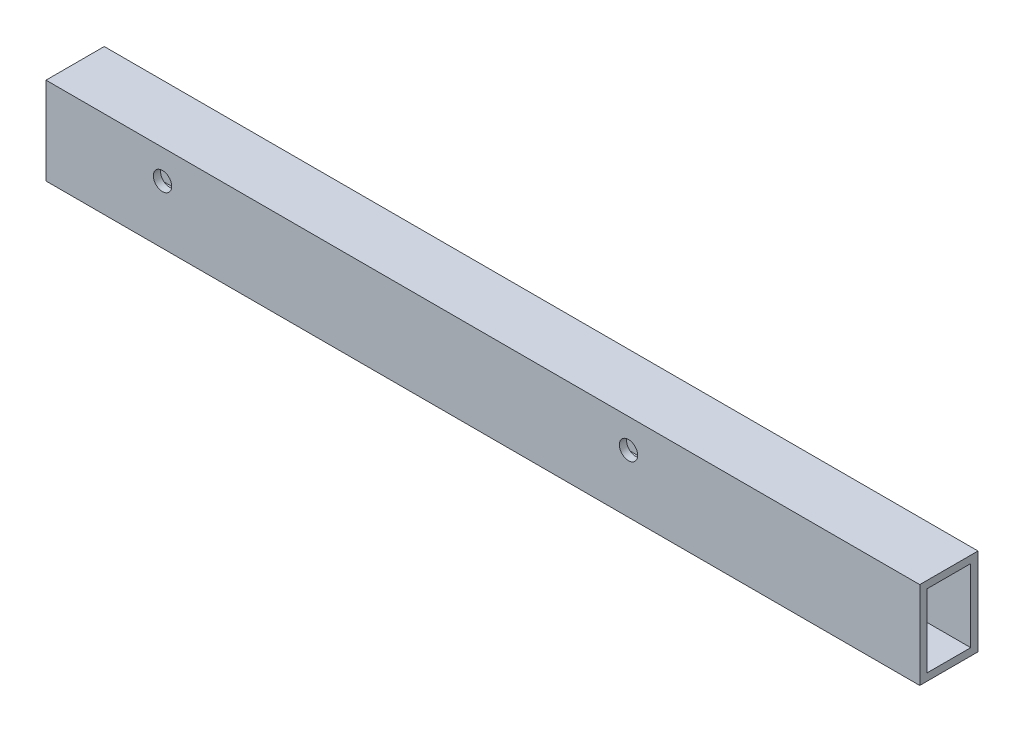
ISO-10303-21;
HEADER;
FILE_DESCRIPTION(('STEP AP214'),'2;1');
FILE_NAME('part.step','',(''),(''),'','','');
FILE_SCHEMA(('AUTOMOTIVE_DESIGN { 1 0 10303 214 1 1 1 1 }'));
ENDSEC;
DATA;
#1=APPLICATION_CONTEXT('core data for automotive mechanical design processes');
#2=APPLICATION_PROTOCOL_DEFINITION('international standard','automotive_design',2000,#1);
#3=PRODUCT_CONTEXT('',#1,'mechanical');
#4=PRODUCT('Part','Part','',(#3));
#5=PRODUCT_RELATED_PRODUCT_CATEGORY('part','',(#4));
#6=PRODUCT_DEFINITION_FORMATION('','',#4);
#7=PRODUCT_DEFINITION_CONTEXT('part definition',#1,'design');
#8=PRODUCT_DEFINITION('design','',#6,#7);
#9=PRODUCT_DEFINITION_SHAPE('','',#8);
#10=(LENGTH_UNIT() NAMED_UNIT(*) SI_UNIT(.MILLI.,.METRE.));
#11=(NAMED_UNIT(*) PLANE_ANGLE_UNIT() SI_UNIT($,.RADIAN.));
#12=(NAMED_UNIT(*) SI_UNIT($,.STERADIAN.) SOLID_ANGLE_UNIT());
#13=UNCERTAINTY_MEASURE_WITH_UNIT(LENGTH_MEASURE(1.E-05),#10,'distance_accuracy_value','');
#14=(GEOMETRIC_REPRESENTATION_CONTEXT(3) GLOBAL_UNCERTAINTY_ASSIGNED_CONTEXT((#13)) GLOBAL_UNIT_ASSIGNED_CONTEXT((#10,
#11,#12)) REPRESENTATION_CONTEXT('',''));
#15=CARTESIAN_POINT('',(0.,0.,0.));
#16=DIRECTION('',(0.,0.,1.));
#17=DIRECTION('',(1.,0.,0.));
#18=AXIS2_PLACEMENT_3D('',#15,#16,#17);
#19=CARTESIAN_POINT('',(381.,0.,0.));
#20=DIRECTION('',(-1.,0.,0.));
#21=DIRECTION('',(0.,0.,1.));
#22=AXIS2_PLACEMENT_3D('',#19,#20,#21);
#23=PLANE('',#22);
#24=DIRECTION('',(0.,1.,0.));
#25=VECTOR('',#24,1.);
#26=CARTESIAN_POINT('',(381.,-19.05,-12.7));
#27=LINE('',#26,#25);
#28=CARTESIAN_POINT('',(381.,-19.05,-12.7));
#29=VERTEX_POINT('',#28);
#30=CARTESIAN_POINT('',(381.,19.05,-12.7));
#31=VERTEX_POINT('',#30);
#32=EDGE_CURVE('E156',#29,#31,#27,.T.);
#33=ORIENTED_EDGE('',*,*,#32,.T.);
#34=DIRECTION('',(0.,0.,1.));
#35=VECTOR('',#34,1.);
#36=CARTESIAN_POINT('',(381.,19.05,12.7));
#37=LINE('',#36,#35);
#38=CARTESIAN_POINT('',(381.,19.05,12.7));
#39=VERTEX_POINT('',#38);
#40=EDGE_CURVE('E160',#31,#39,#37,.T.);
#41=ORIENTED_EDGE('',*,*,#40,.T.);
#42=DIRECTION('',(0.,-1.,0.));
#43=VECTOR('',#42,1.);
#44=CARTESIAN_POINT('',(381.,-19.05,12.7));
#45=LINE('',#44,#43);
#46=CARTESIAN_POINT('',(381.,-19.05,12.7));
#47=VERTEX_POINT('',#46);
#48=EDGE_CURVE('E164',#39,#47,#45,.T.);
#49=ORIENTED_EDGE('',*,*,#48,.T.);
#50=DIRECTION('',(0.,0.,-1.));
#51=VECTOR('',#50,1.);
#52=CARTESIAN_POINT('',(381.,-19.05,12.7));
#53=LINE('',#52,#51);
#54=EDGE_CURVE('E167',#47,#29,#53,.T.);
#55=ORIENTED_EDGE('',*,*,#54,.T.);
#56=EDGE_LOOP('',(#33,#41,#49,#55));
#57=FACE_BOUND('',#56,.T.);
#58=DIRECTION('',(0.,0.,-1.));
#59=VECTOR('',#58,1.);
#60=CARTESIAN_POINT('',(381.,-15.875,9.525));
#61=LINE('',#60,#59);
#62=CARTESIAN_POINT('',(381.,-15.875,9.525));
#63=VERTEX_POINT('',#62);
#64=CARTESIAN_POINT('',(381.,-15.875,-9.525));
#65=VERTEX_POINT('',#64);
#66=EDGE_CURVE('E106',#63,#65,#61,.T.);
#67=ORIENTED_EDGE('',*,*,#66,.F.);
#68=DIRECTION('',(0.,-1.,0.));
#69=VECTOR('',#68,1.);
#70=CARTESIAN_POINT('',(381.,-15.875,9.525));
#71=LINE('',#70,#69);
#72=CARTESIAN_POINT('',(381.,15.875,9.525));
#73=VERTEX_POINT('',#72);
#74=EDGE_CURVE('E132',#73,#63,#71,.T.);
#75=ORIENTED_EDGE('',*,*,#74,.F.);
#76=DIRECTION('',(0.,0.,1.));
#77=VECTOR('',#76,1.);
#78=CARTESIAN_POINT('',(381.,15.875,9.525));
#79=LINE('',#78,#77);
#80=CARTESIAN_POINT('',(381.,15.875,-9.525));
#81=VERTEX_POINT('',#80);
#82=EDGE_CURVE('E128',#81,#73,#79,.T.);
#83=ORIENTED_EDGE('',*,*,#82,.F.);
#84=DIRECTION('',(0.,1.,0.));
#85=VECTOR('',#84,1.);
#86=CARTESIAN_POINT('',(381.,-15.875,-9.525));
#87=LINE('',#86,#85);
#88=EDGE_CURVE('E115',#65,#81,#87,.T.);
#89=ORIENTED_EDGE('',*,*,#88,.F.);
#90=EDGE_LOOP('',(#67,#75,#83,#89));
#91=FACE_BOUND('',#90,.T.);
#92=ADVANCED_FACE('F38',(#57,#91),#23,.F.);
#93=CARTESIAN_POINT('',(0.,0.,0.));
#94=DIRECTION('',(-1.,0.,0.));
#95=DIRECTION('',(0.,0.,1.));
#96=AXIS2_PLACEMENT_3D('',#93,#94,#95);
#97=PLANE('',#96);
#98=DIRECTION('',(0.,1.,0.));
#99=VECTOR('',#98,1.);
#100=CARTESIAN_POINT('',(0.,-19.05,-12.7));
#101=LINE('',#100,#99);
#102=CARTESIAN_POINT('',(0.,-19.05,-12.7));
#103=VERTEX_POINT('',#102);
#104=CARTESIAN_POINT('',(0.,19.05,-12.7));
#105=VERTEX_POINT('',#104);
#106=EDGE_CURVE('E124',#103,#105,#101,.T.);
#107=ORIENTED_EDGE('',*,*,#106,.F.);
#108=DIRECTION('',(0.,0.,-1.));
#109=VECTOR('',#108,1.);
#110=CARTESIAN_POINT('',(0.,-19.05,12.7));
#111=LINE('',#110,#109);
#112=CARTESIAN_POINT('',(0.,-19.05,12.7));
#113=VERTEX_POINT('',#112);
#114=EDGE_CURVE('E161',#113,#103,#111,.T.);
#115=ORIENTED_EDGE('',*,*,#114,.F.);
#116=DIRECTION('',(0.,-1.,0.));
#117=VECTOR('',#116,1.);
#118=CARTESIAN_POINT('',(0.,-19.05,12.7));
#119=LINE('',#118,#117);
#120=CARTESIAN_POINT('',(0.,19.05,12.7));
#121=VERTEX_POINT('',#120);
#122=EDGE_CURVE('E177',#121,#113,#119,.T.);
#123=ORIENTED_EDGE('',*,*,#122,.F.);
#124=DIRECTION('',(0.,0.,1.));
#125=VECTOR('',#124,1.);
#126=CARTESIAN_POINT('',(0.,19.05,12.7));
#127=LINE('',#126,#125);
#128=EDGE_CURVE('E174',#105,#121,#127,.T.);
#129=ORIENTED_EDGE('',*,*,#128,.F.);
#130=EDGE_LOOP('',(#107,#115,#123,#129));
#131=FACE_BOUND('',#130,.T.);
#132=DIRECTION('',(0.,-1.,0.));
#133=VECTOR('',#132,1.);
#134=CARTESIAN_POINT('',(0.,-15.875,9.525));
#135=LINE('',#134,#133);
#136=CARTESIAN_POINT('',(0.,15.875,9.525));
#137=VERTEX_POINT('',#136);
#138=CARTESIAN_POINT('',(0.,-15.875,9.525));
#139=VERTEX_POINT('',#138);
#140=EDGE_CURVE('E116',#137,#139,#135,.T.);
#141=ORIENTED_EDGE('',*,*,#140,.T.);
#142=DIRECTION('',(0.,0.,-1.));
#143=VECTOR('',#142,1.);
#144=CARTESIAN_POINT('',(0.,-15.875,9.525));
#145=LINE('',#144,#143);
#146=CARTESIAN_POINT('',(0.,-15.875,-9.525));
#147=VERTEX_POINT('',#146);
#148=EDGE_CURVE('E64',#139,#147,#145,.T.);
#149=ORIENTED_EDGE('',*,*,#148,.T.);
#150=DIRECTION('',(0.,1.,0.));
#151=VECTOR('',#150,1.);
#152=CARTESIAN_POINT('',(0.,-15.875,-9.525));
#153=LINE('',#152,#151);
#154=CARTESIAN_POINT('',(0.,15.875,-9.525));
#155=VERTEX_POINT('',#154);
#156=EDGE_CURVE('E122',#147,#155,#153,.T.);
#157=ORIENTED_EDGE('',*,*,#156,.T.);
#158=DIRECTION('',(0.,0.,1.));
#159=VECTOR('',#158,1.);
#160=CARTESIAN_POINT('',(0.,15.875,9.525));
#161=LINE('',#160,#159);
#162=EDGE_CURVE('E143',#155,#137,#161,.T.);
#163=ORIENTED_EDGE('',*,*,#162,.T.);
#164=EDGE_LOOP('',(#141,#149,#157,#163));
#165=FACE_BOUND('',#164,.T.);
#166=ADVANCED_FACE('F237',(#131,#165),#97,.T.);
#167=CARTESIAN_POINT('',(381.,-19.05,-12.7));
#168=DIRECTION('',(0.,0.,1.));
#169=DIRECTION('',(1.,0.,0.));
#170=AXIS2_PLACEMENT_3D('',#167,#168,#169);
#171=PLANE('',#170);
#172=CARTESIAN_POINT('',(50.8,6.35,-12.7));
#173=DIRECTION('',(0.,0.,-1.));
#174=DIRECTION('',(-1.,0.,0.));
#175=AXIS2_PLACEMENT_3D('',#172,#173,#174);
#176=CIRCLE('',#175,3.99999999999999);
#177=CARTESIAN_POINT('',(46.8,6.35,-12.7));
#178=VERTEX_POINT('',#177);
#179=EDGE_CURVE('E203',#178,#178,#176,.T.);
#180=ORIENTED_EDGE('',*,*,#179,.F.);
#181=EDGE_LOOP('',(#180));
#182=FACE_BOUND('',#181,.T.);
#183=CARTESIAN_POINT('',(254.,6.34999999999997,-12.7));
#184=DIRECTION('',(0.,0.,-1.));
#185=DIRECTION('',(-1.,0.,0.));
#186=AXIS2_PLACEMENT_3D('',#183,#184,#185);
#187=CIRCLE('',#186,3.99999999999999);
#188=CARTESIAN_POINT('',(250.,6.34999999999997,-12.7));
#189=VERTEX_POINT('',#188);
#190=EDGE_CURVE('E215',#189,#189,#187,.T.);
#191=ORIENTED_EDGE('',*,*,#190,.F.);
#192=EDGE_LOOP('',(#191));
#193=FACE_BOUND('',#192,.T.);
#194=ORIENTED_EDGE('',*,*,#106,.T.);
#195=DIRECTION('',(-1.,0.,0.));
#196=VECTOR('',#195,1.);
#197=CARTESIAN_POINT('',(381.,19.05,-12.7));
#198=LINE('',#197,#196);
#199=EDGE_CURVE('E11',#31,#105,#198,.T.);
#200=ORIENTED_EDGE('',*,*,#199,.F.);
#201=ORIENTED_EDGE('',*,*,#32,.F.);
#202=DIRECTION('',(-1.,0.,0.));
#203=VECTOR('',#202,1.);
#204=CARTESIAN_POINT('',(381.,-19.05,-12.7));
#205=LINE('',#204,#203);
#206=EDGE_CURVE('E170',#29,#103,#205,.T.);
#207=ORIENTED_EDGE('',*,*,#206,.T.);
#208=EDGE_LOOP('',(#194,#200,#201,#207));
#209=FACE_BOUND('',#208,.T.);
#210=ADVANCED_FACE('F40',(#182,#193,#209),#171,.F.);
#211=CARTESIAN_POINT('',(381.,19.05,12.7));
#212=DIRECTION('',(0.,-1.,0.));
#213=DIRECTION('',(0.,0.,-1.));
#214=AXIS2_PLACEMENT_3D('',#211,#212,#213);
#215=PLANE('',#214);
#216=ORIENTED_EDGE('',*,*,#128,.T.);
#217=DIRECTION('',(-1.,0.,0.));
#218=VECTOR('',#217,1.);
#219=CARTESIAN_POINT('',(381.,19.05,12.7));
#220=LINE('',#219,#218);
#221=EDGE_CURVE('E48',#39,#121,#220,.T.);
#222=ORIENTED_EDGE('',*,*,#221,.F.);
#223=ORIENTED_EDGE('',*,*,#40,.F.);
#224=ORIENTED_EDGE('',*,*,#199,.T.);
#225=EDGE_LOOP('',(#216,#222,#223,#224));
#226=FACE_BOUND('',#225,.T.);
#227=ADVANCED_FACE('F264',(#226),#215,.F.);
#228=CARTESIAN_POINT('',(381.,-19.05,12.7));
#229=DIRECTION('',(0.,0.,-1.));
#230=DIRECTION('',(-1.,0.,0.));
#231=AXIS2_PLACEMENT_3D('',#228,#229,#230);
#232=PLANE('',#231);
#233=CARTESIAN_POINT('',(50.8,6.35,12.7));
#234=DIRECTION('',(0.,0.,-1.));
#235=DIRECTION('',(-1.,0.,0.));
#236=AXIS2_PLACEMENT_3D('',#233,#234,#235);
#237=CIRCLE('',#236,3.99999999999999);
#238=CARTESIAN_POINT('',(46.8,6.35,12.7));
#239=VERTEX_POINT('',#238);
#240=EDGE_CURVE('E195',#239,#239,#237,.T.);
#241=ORIENTED_EDGE('',*,*,#240,.T.);
#242=EDGE_LOOP('',(#241));
#243=FACE_BOUND('',#242,.T.);
#244=CARTESIAN_POINT('',(254.,6.34999999999997,12.7));
#245=DIRECTION('',(0.,0.,-1.));
#246=DIRECTION('',(-1.,0.,0.));
#247=AXIS2_PLACEMENT_3D('',#244,#245,#246);
#248=CIRCLE('',#247,3.99999999999999);
#249=CARTESIAN_POINT('',(250.,6.34999999999997,12.7));
#250=VERTEX_POINT('',#249);
#251=EDGE_CURVE('E209',#250,#250,#248,.T.);
#252=ORIENTED_EDGE('',*,*,#251,.T.);
#253=EDGE_LOOP('',(#252));
#254=FACE_BOUND('',#253,.T.);
#255=ORIENTED_EDGE('',*,*,#122,.T.);
#256=DIRECTION('',(-1.,0.,0.));
#257=VECTOR('',#256,1.);
#258=CARTESIAN_POINT('',(381.,-19.05,12.7));
#259=LINE('',#258,#257);
#260=EDGE_CURVE('E185',#47,#113,#259,.T.);
#261=ORIENTED_EDGE('',*,*,#260,.F.);
#262=ORIENTED_EDGE('',*,*,#48,.F.);
#263=ORIENTED_EDGE('',*,*,#221,.T.);
#264=EDGE_LOOP('',(#255,#261,#262,#263));
#265=FACE_BOUND('',#264,.T.);
#266=ADVANCED_FACE('F261',(#243,#254,#265),#232,.F.);
#267=CARTESIAN_POINT('',(381.,-19.05,12.7));
#268=DIRECTION('',(0.,1.,0.));
#269=DIRECTION('',(0.,0.,1.));
#270=AXIS2_PLACEMENT_3D('',#267,#268,#269);
#271=PLANE('',#270);
#272=ORIENTED_EDGE('',*,*,#114,.T.);
#273=ORIENTED_EDGE('',*,*,#206,.F.);
#274=ORIENTED_EDGE('',*,*,#54,.F.);
#275=ORIENTED_EDGE('',*,*,#260,.T.);
#276=EDGE_LOOP('',(#272,#273,#274,#275));
#277=FACE_BOUND('',#276,.T.);
#278=ADVANCED_FACE('F258',(#277),#271,.F.);
#279=CARTESIAN_POINT('',(381.,-15.875,9.525));
#280=DIRECTION('',(0.,1.,0.));
#281=DIRECTION('',(0.,0.,1.));
#282=AXIS2_PLACEMENT_3D('',#279,#280,#281);
#283=PLANE('',#282);
#284=ORIENTED_EDGE('',*,*,#148,.F.);
#285=DIRECTION('',(-1.,0.,0.));
#286=VECTOR('',#285,1.);
#287=CARTESIAN_POINT('',(381.,-15.875,9.525));
#288=LINE('',#287,#286);
#289=EDGE_CURVE('E110',#63,#139,#288,.T.);
#290=ORIENTED_EDGE('',*,*,#289,.F.);
#291=ORIENTED_EDGE('',*,*,#66,.T.);
#292=DIRECTION('',(-1.,0.,0.));
#293=VECTOR('',#292,1.);
#294=CARTESIAN_POINT('',(381.,-15.875,-9.525));
#295=LINE('',#294,#293);
#296=EDGE_CURVE('E109',#65,#147,#295,.T.);
#297=ORIENTED_EDGE('',*,*,#296,.T.);
#298=EDGE_LOOP('',(#284,#290,#291,#297));
#299=FACE_BOUND('',#298,.T.);
#300=ADVANCED_FACE('F108',(#299),#283,.T.);
#301=CARTESIAN_POINT('',(381.,-15.875,-9.525));
#302=DIRECTION('',(0.,0.,1.));
#303=DIRECTION('',(1.,0.,0.));
#304=AXIS2_PLACEMENT_3D('',#301,#302,#303);
#305=PLANE('',#304);
#306=CARTESIAN_POINT('',(50.8,6.35,-9.525));
#307=DIRECTION('',(0.,0.,1.));
#308=DIRECTION('',(1.,0.,0.));
#309=AXIS2_PLACEMENT_3D('',#306,#307,#308);
#310=CIRCLE('',#309,3.99999999999999);
#311=CARTESIAN_POINT('',(54.8,6.35,-9.525));
#312=VERTEX_POINT('',#311);
#313=EDGE_CURVE('E140',#312,#312,#310,.T.);
#314=ORIENTED_EDGE('',*,*,#313,.F.);
#315=EDGE_LOOP('',(#314));
#316=FACE_BOUND('',#315,.T.);
#317=CARTESIAN_POINT('',(254.,6.34999999999997,-9.525));
#318=DIRECTION('',(0.,0.,1.));
#319=DIRECTION('',(1.,0.,0.));
#320=AXIS2_PLACEMENT_3D('',#317,#318,#319);
#321=CIRCLE('',#320,3.99999999999999);
#322=CARTESIAN_POINT('',(258.,6.34999999999997,-9.525));
#323=VERTEX_POINT('',#322);
#324=EDGE_CURVE('E194',#323,#323,#321,.T.);
#325=ORIENTED_EDGE('',*,*,#324,.F.);
#326=EDGE_LOOP('',(#325));
#327=FACE_BOUND('',#326,.T.);
#328=ORIENTED_EDGE('',*,*,#156,.F.);
#329=ORIENTED_EDGE('',*,*,#296,.F.);
#330=ORIENTED_EDGE('',*,*,#88,.T.);
#331=DIRECTION('',(-1.,0.,0.));
#332=VECTOR('',#331,1.);
#333=CARTESIAN_POINT('',(381.,15.875,-9.525));
#334=LINE('',#333,#332);
#335=EDGE_CURVE('E125',#81,#155,#334,.T.);
#336=ORIENTED_EDGE('',*,*,#335,.T.);
#337=EDGE_LOOP('',(#328,#329,#330,#336));
#338=FACE_BOUND('',#337,.T.);
#339=ADVANCED_FACE('F119',(#316,#327,#338),#305,.T.);
#340=CARTESIAN_POINT('',(381.,15.875,9.525));
#341=DIRECTION('',(0.,-1.,0.));
#342=DIRECTION('',(0.,0.,-1.));
#343=AXIS2_PLACEMENT_3D('',#340,#341,#342);
#344=PLANE('',#343);
#345=ORIENTED_EDGE('',*,*,#162,.F.);
#346=ORIENTED_EDGE('',*,*,#335,.F.);
#347=ORIENTED_EDGE('',*,*,#82,.T.);
#348=DIRECTION('',(-1.,0.,0.));
#349=VECTOR('',#348,1.);
#350=CARTESIAN_POINT('',(381.,15.875,9.525));
#351=LINE('',#350,#349);
#352=EDGE_CURVE('E56',#73,#137,#351,.T.);
#353=ORIENTED_EDGE('',*,*,#352,.T.);
#354=EDGE_LOOP('',(#345,#346,#347,#353));
#355=FACE_BOUND('',#354,.T.);
#356=ADVANCED_FACE('F233',(#355),#344,.T.);
#357=CARTESIAN_POINT('',(381.,-15.875,9.525));
#358=DIRECTION('',(0.,0.,-1.));
#359=DIRECTION('',(-1.,0.,0.));
#360=AXIS2_PLACEMENT_3D('',#357,#358,#359);
#361=PLANE('',#360);
#362=CARTESIAN_POINT('',(50.8,6.35,9.525));
#363=DIRECTION('',(0.,0.,-1.));
#364=DIRECTION('',(-1.,0.,0.));
#365=AXIS2_PLACEMENT_3D('',#362,#363,#364);
#366=CIRCLE('',#365,3.99999999999999);
#367=CARTESIAN_POINT('',(46.8,6.35,9.525));
#368=VERTEX_POINT('',#367);
#369=EDGE_CURVE('E42',#368,#368,#366,.T.);
#370=ORIENTED_EDGE('',*,*,#369,.F.);
#371=EDGE_LOOP('',(#370));
#372=FACE_BOUND('',#371,.T.);
#373=CARTESIAN_POINT('',(254.,6.34999999999997,9.525));
#374=DIRECTION('',(0.,0.,-1.));
#375=DIRECTION('',(-1.,0.,0.));
#376=AXIS2_PLACEMENT_3D('',#373,#374,#375);
#377=CIRCLE('',#376,3.99999999999999);
#378=CARTESIAN_POINT('',(250.,6.34999999999997,9.525));
#379=VERTEX_POINT('',#378);
#380=EDGE_CURVE('E191',#379,#379,#377,.T.);
#381=ORIENTED_EDGE('',*,*,#380,.F.);
#382=EDGE_LOOP('',(#381));
#383=FACE_BOUND('',#382,.T.);
#384=ORIENTED_EDGE('',*,*,#140,.F.);
#385=ORIENTED_EDGE('',*,*,#352,.F.);
#386=ORIENTED_EDGE('',*,*,#74,.T.);
#387=ORIENTED_EDGE('',*,*,#289,.T.);
#388=EDGE_LOOP('',(#384,#385,#386,#387));
#389=FACE_BOUND('',#388,.T.);
#390=ADVANCED_FACE('F229',(#372,#383,#389),#361,.T.);
#391=CARTESIAN_POINT('',(254.,6.34999999999997,12.7));
#392=DIRECTION('',(0.,0.,-1.));
#393=DIRECTION('',(-1.,0.,0.));
#394=AXIS2_PLACEMENT_3D('',#391,#392,#393);
#395=CYLINDRICAL_SURFACE('',#394,3.99999999999999);
#396=ORIENTED_EDGE('',*,*,#380,.T.);
#397=EDGE_LOOP('',(#396));
#398=FACE_BOUND('',#397,.T.);
#399=ORIENTED_EDGE('',*,*,#251,.F.);
#400=EDGE_LOOP('',(#399));
#401=FACE_BOUND('',#400,.T.);
#402=ADVANCED_FACE('F232',(#398,#401),#395,.F.);
#403=CARTESIAN_POINT('',(50.8,6.35,12.7));
#404=DIRECTION('',(0.,0.,-1.));
#405=DIRECTION('',(-1.,0.,0.));
#406=AXIS2_PLACEMENT_3D('',#403,#404,#405);
#407=CYLINDRICAL_SURFACE('',#406,3.99999999999999);
#408=ORIENTED_EDGE('',*,*,#369,.T.);
#409=EDGE_LOOP('',(#408));
#410=FACE_BOUND('',#409,.T.);
#411=ORIENTED_EDGE('',*,*,#240,.F.);
#412=EDGE_LOOP('',(#411));
#413=FACE_BOUND('',#412,.T.);
#414=ADVANCED_FACE('F226',(#410,#413),#407,.F.);
#415=ORIENTED_EDGE('',*,*,#324,.T.);
#416=EDGE_LOOP('',(#415));
#417=FACE_BOUND('',#416,.T.);
#418=ORIENTED_EDGE('',*,*,#190,.T.);
#419=EDGE_LOOP('',(#418));
#420=FACE_BOUND('',#419,.T.);
#421=ADVANCED_FACE('F290',(#417,#420),#395,.F.);
#422=ORIENTED_EDGE('',*,*,#313,.T.);
#423=EDGE_LOOP('',(#422));
#424=FACE_BOUND('',#423,.T.);
#425=ORIENTED_EDGE('',*,*,#179,.T.);
#426=EDGE_LOOP('',(#425));
#427=FACE_BOUND('',#426,.T.);
#428=ADVANCED_FACE('F292',(#424,#427),#407,.F.);
#429=CLOSED_SHELL('',(#92,#166,#210,#227,#266,#278,#300,#339,#356,#390,#402,#414,#421,#428));
#430=MANIFOLD_SOLID_BREP('B2',#429);
#431=ADVANCED_BREP_SHAPE_REPRESENTATION('',(#18,#430),#14);
#432=SHAPE_DEFINITION_REPRESENTATION(#9,#431);
ENDSEC;
END-ISO-10303-21;
